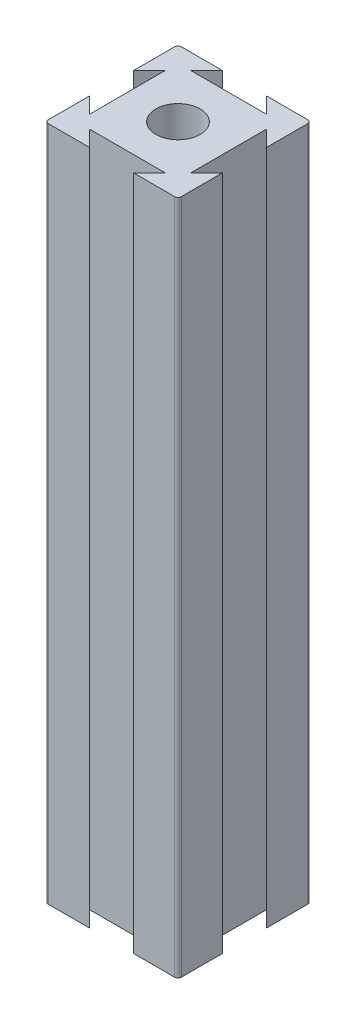
ISO-10303-21;
HEADER;
FILE_DESCRIPTION(('STEP AP214'),'2;1');
FILE_NAME('part.step','',(''),(''),'','','');
FILE_SCHEMA(('AUTOMOTIVE_DESIGN { 1 0 10303 214 1 1 1 1 }'));
ENDSEC;
DATA;
#1=APPLICATION_CONTEXT('core data for automotive mechanical design processes');
#2=APPLICATION_PROTOCOL_DEFINITION('international standard','automotive_design',2000,#1);
#3=PRODUCT_CONTEXT('',#1,'mechanical');
#4=PRODUCT('Part','Part','',(#3));
#5=PRODUCT_RELATED_PRODUCT_CATEGORY('part','',(#4));
#6=PRODUCT_DEFINITION_FORMATION('','',#4);
#7=PRODUCT_DEFINITION_CONTEXT('part definition',#1,'design');
#8=PRODUCT_DEFINITION('design','',#6,#7);
#9=PRODUCT_DEFINITION_SHAPE('','',#8);
#10=(LENGTH_UNIT() NAMED_UNIT(*) SI_UNIT(.MILLI.,.METRE.));
#11=(NAMED_UNIT(*) PLANE_ANGLE_UNIT() SI_UNIT($,.RADIAN.));
#12=(NAMED_UNIT(*) SI_UNIT($,.STERADIAN.) SOLID_ANGLE_UNIT());
#13=UNCERTAINTY_MEASURE_WITH_UNIT(LENGTH_MEASURE(1.E-05),#10,'distance_accuracy_value','');
#14=(GEOMETRIC_REPRESENTATION_CONTEXT(3) GLOBAL_UNCERTAINTY_ASSIGNED_CONTEXT((#13)) GLOBAL_UNIT_ASSIGNED_CONTEXT((#10,
#11,#12)) REPRESENTATION_CONTEXT('',''));
#15=CARTESIAN_POINT('',(0.,0.,0.));
#16=DIRECTION('',(0.,0.,1.));
#17=DIRECTION('',(1.,0.,0.));
#18=AXIS2_PLACEMENT_3D('',#15,#16,#17);
#19=CARTESIAN_POINT('',(16.6666666666667,101.6,-16.6666666666667));
#20=DIRECTION('',(-0.707106781186547,0.,0.707106781186548));
#21=DIRECTION('',(0.707106781186548,0.,0.707106781186547));
#22=AXIS2_PLACEMENT_3D('',#19,#20,#21);
#23=PLANE('',#22);
#24=DIRECTION('',(-0.707106781186548,0.,-0.707106781186547));
#25=VECTOR('',#24,1.);
#26=CARTESIAN_POINT('',(16.6666666666667,0.,-16.6666666666667));
#27=LINE('',#26,#25);
#28=CARTESIAN_POINT('',(20.,0.,-13.3333333333333));
#29=VERTEX_POINT('',#28);
#30=CARTESIAN_POINT('',(17.6183333333333,0.,-15.715));
#31=VERTEX_POINT('',#30);
#32=EDGE_CURVE('E201',#29,#31,#27,.T.);
#33=ORIENTED_EDGE('',*,*,#32,.F.);
#34=DIRECTION('',(0.,-1.,0.));
#35=VECTOR('',#34,1.);
#36=CARTESIAN_POINT('',(20.,101.6,-13.3333333333333));
#37=LINE('',#36,#35);
#38=CARTESIAN_POINT('',(20.,101.6,-13.3333333333333));
#39=VERTEX_POINT('',#38);
#40=EDGE_CURVE('E195',#39,#29,#37,.T.);
#41=ORIENTED_EDGE('',*,*,#40,.F.);
#42=DIRECTION('',(-0.707106781186548,0.,-0.707106781186547));
#43=VECTOR('',#42,1.);
#44=CARTESIAN_POINT('',(16.6666666666667,101.6,-16.6666666666667));
#45=LINE('',#44,#43);
#46=CARTESIAN_POINT('',(17.6183333333333,101.6,-15.715));
#47=VERTEX_POINT('',#46);
#48=EDGE_CURVE('E198',#39,#47,#45,.T.);
#49=ORIENTED_EDGE('',*,*,#48,.T.);
#50=DIRECTION('',(0.,-1.,0.));
#51=VECTOR('',#50,1.);
#52=CARTESIAN_POINT('',(17.6183333333333,101.6,-15.715));
#53=LINE('',#52,#51);
#54=EDGE_CURVE('E269',#47,#31,#53,.T.);
#55=ORIENTED_EDGE('',*,*,#54,.T.);
#56=EDGE_LOOP('',(#33,#41,#49,#55));
#57=FACE_BOUND('',#56,.T.);
#58=ADVANCED_FACE('F35',(#57),#23,.T.);
#59=CARTESIAN_POINT('',(20.,101.6,0.));
#60=DIRECTION('',(-1.,0.,0.));
#61=DIRECTION('',(0.,0.,1.));
#62=AXIS2_PLACEMENT_3D('',#59,#60,#61);
#63=PLANE('',#62);
#64=DIRECTION('',(0.,0.,-1.));
#65=VECTOR('',#64,1.);
#66=CARTESIAN_POINT('',(20.,0.,0.));
#67=LINE('',#66,#65);
#68=CARTESIAN_POINT('',(20.,0.,-19.492));
#69=VERTEX_POINT('',#68);
#70=EDGE_CURVE('E274',#29,#69,#67,.T.);
#71=ORIENTED_EDGE('',*,*,#70,.T.);
#72=DIRECTION('',(0.,-1.,0.));
#73=VECTOR('',#72,1.);
#74=CARTESIAN_POINT('',(20.,101.6,-19.492));
#75=LINE('',#74,#73);
#76=CARTESIAN_POINT('',(20.,101.6,-19.492));
#77=VERTEX_POINT('',#76);
#78=EDGE_CURVE('E212',#69,#77,#75,.F.);
#79=ORIENTED_EDGE('',*,*,#78,.T.);
#80=DIRECTION('',(0.,0.,-1.));
#81=VECTOR('',#80,1.);
#82=CARTESIAN_POINT('',(20.,101.6,0.));
#83=LINE('',#82,#81);
#84=EDGE_CURVE('E209',#39,#77,#83,.T.);
#85=ORIENTED_EDGE('',*,*,#84,.F.);
#86=ORIENTED_EDGE('',*,*,#40,.T.);
#87=EDGE_LOOP('',(#71,#79,#85,#86));
#88=FACE_BOUND('',#87,.T.);
#89=ADVANCED_FACE('F210',(#88),#63,.F.);
#90=CARTESIAN_POINT('',(0.,101.6,-20.));
#91=DIRECTION('',(0.,0.,-1.));
#92=DIRECTION('',(-1.,0.,0.));
#93=AXIS2_PLACEMENT_3D('',#90,#91,#92);
#94=PLANE('',#93);
#95=DIRECTION('',(1.,0.,0.));
#96=VECTOR('',#95,1.);
#97=CARTESIAN_POINT('',(0.,101.6,-20.));
#98=LINE('',#97,#96);
#99=CARTESIAN_POINT('',(13.3333333333333,101.6,-20.));
#100=VERTEX_POINT('',#99);
#101=CARTESIAN_POINT('',(19.492,101.6,-20.));
#102=VERTEX_POINT('',#101);
#103=EDGE_CURVE('E214',#100,#102,#98,.T.);
#104=ORIENTED_EDGE('',*,*,#103,.T.);
#105=DIRECTION('',(0.,-1.,0.));
#106=VECTOR('',#105,1.);
#107=CARTESIAN_POINT('',(19.492,0.,-20.));
#108=LINE('',#107,#106);
#109=CARTESIAN_POINT('',(19.492,0.,-20.));
#110=VERTEX_POINT('',#109);
#111=EDGE_CURVE('E376',#102,#110,#108,.T.);
#112=ORIENTED_EDGE('',*,*,#111,.T.);
#113=DIRECTION('',(1.,0.,0.));
#114=VECTOR('',#113,1.);
#115=CARTESIAN_POINT('',(0.,0.,-20.));
#116=LINE('',#115,#114);
#117=CARTESIAN_POINT('',(13.3333333333333,0.,-20.));
#118=VERTEX_POINT('',#117);
#119=EDGE_CURVE('E276',#118,#110,#116,.T.);
#120=ORIENTED_EDGE('',*,*,#119,.F.);
#121=DIRECTION('',(0.,-1.,0.));
#122=VECTOR('',#121,1.);
#123=CARTESIAN_POINT('',(13.3333333333333,101.6,-20.));
#124=LINE('',#123,#122);
#125=EDGE_CURVE('E206',#100,#118,#124,.T.);
#126=ORIENTED_EDGE('',*,*,#125,.F.);
#127=EDGE_LOOP('',(#104,#112,#120,#126));
#128=FACE_BOUND('',#127,.T.);
#129=ADVANCED_FACE('F408',(#128),#94,.T.);
#130=CARTESIAN_POINT('',(16.6666666666666,101.6,-16.6666666666668));
#131=DIRECTION('',(-0.707106781186544,0.,0.707106781186551));
#132=DIRECTION('',(0.707106781186551,0.,0.707106781186544));
#133=AXIS2_PLACEMENT_3D('',#130,#131,#132);
#134=PLANE('',#133);
#135=DIRECTION('',(-0.707106781186551,0.,-0.707106781186544));
#136=VECTOR('',#135,1.);
#137=CARTESIAN_POINT('',(16.6666666666666,0.,-16.6666666666668));
#138=LINE('',#137,#136);
#139=CARTESIAN_POINT('',(15.715,0.,-17.6183333333334));
#140=VERTEX_POINT('',#139);
#141=EDGE_CURVE('E280',#140,#118,#138,.T.);
#142=ORIENTED_EDGE('',*,*,#141,.F.);
#143=DIRECTION('',(0.,-1.,0.));
#144=VECTOR('',#143,1.);
#145=CARTESIAN_POINT('',(15.715,101.6,-17.6183333333334));
#146=LINE('',#145,#144);
#147=CARTESIAN_POINT('',(15.715,101.6,-17.6183333333334));
#148=VERTEX_POINT('',#147);
#149=EDGE_CURVE('E354',#148,#140,#146,.T.);
#150=ORIENTED_EDGE('',*,*,#149,.F.);
#151=DIRECTION('',(-0.707106781186551,0.,-0.707106781186544));
#152=VECTOR('',#151,1.);
#153=CARTESIAN_POINT('',(16.6666666666666,101.6,-16.6666666666668));
#154=LINE('',#153,#152);
#155=EDGE_CURVE('E230',#148,#100,#154,.T.);
#156=ORIENTED_EDGE('',*,*,#155,.T.);
#157=ORIENTED_EDGE('',*,*,#125,.T.);
#158=EDGE_LOOP('',(#142,#150,#156,#157));
#159=FACE_BOUND('',#158,.T.);
#160=ADVANCED_FACE('F412',(#159),#134,.T.);
#161=CARTESIAN_POINT('',(0.,101.6,-17.6183333333334));
#162=DIRECTION('',(0.,0.,-1.));
#163=DIRECTION('',(-1.,0.,0.));
#164=AXIS2_PLACEMENT_3D('',#161,#162,#163);
#165=PLANE('',#164);
#166=DIRECTION('',(1.,0.,0.));
#167=VECTOR('',#166,1.);
#168=CARTESIAN_POINT('',(0.,0.,-17.6183333333334));
#169=LINE('',#168,#167);
#170=CARTESIAN_POINT('',(4.285,0.,-17.6183333333334));
#171=VERTEX_POINT('',#170);
#172=EDGE_CURVE('E284',#171,#140,#169,.T.);
#173=ORIENTED_EDGE('',*,*,#172,.F.);
#174=DIRECTION('',(0.,-1.,0.));
#175=VECTOR('',#174,1.);
#176=CARTESIAN_POINT('',(4.285,101.6,-17.6183333333334));
#177=LINE('',#176,#175);
#178=CARTESIAN_POINT('',(4.285,101.6,-17.6183333333334));
#179=VERTEX_POINT('',#178);
#180=EDGE_CURVE('E352',#179,#171,#177,.T.);
#181=ORIENTED_EDGE('',*,*,#180,.F.);
#182=DIRECTION('',(1.,0.,0.));
#183=VECTOR('',#182,1.);
#184=CARTESIAN_POINT('',(0.,101.6,-17.6183333333334));
#185=LINE('',#184,#183);
#186=EDGE_CURVE('E234',#179,#148,#185,.T.);
#187=ORIENTED_EDGE('',*,*,#186,.T.);
#188=ORIENTED_EDGE('',*,*,#149,.T.);
#189=EDGE_LOOP('',(#173,#181,#187,#188));
#190=FACE_BOUND('',#189,.T.);
#191=ADVANCED_FACE('F439',(#190),#165,.T.);
#192=CARTESIAN_POINT('',(-6.6666666666667,101.6,-6.66666666666677));
#193=DIRECTION('',(0.707106781186544,0.,0.707106781186551));
#194=DIRECTION('',(0.707106781186551,0.,-0.707106781186544));
#195=AXIS2_PLACEMENT_3D('',#192,#193,#194);
#196=PLANE('',#195);
#197=DIRECTION('',(-0.707106781186551,0.,0.707106781186544));
#198=VECTOR('',#197,1.);
#199=CARTESIAN_POINT('',(-6.6666666666667,0.,-6.66666666666677));
#200=LINE('',#199,#198);
#201=CARTESIAN_POINT('',(6.66666666666666,0.,-20.));
#202=VERTEX_POINT('',#201);
#203=EDGE_CURVE('E287',#202,#171,#200,.T.);
#204=ORIENTED_EDGE('',*,*,#203,.F.);
#205=DIRECTION('',(0.,-1.,0.));
#206=VECTOR('',#205,1.);
#207=CARTESIAN_POINT('',(6.66666666666666,101.6,-20.));
#208=LINE('',#207,#206);
#209=CARTESIAN_POINT('',(6.66666666666666,101.6,-20.));
#210=VERTEX_POINT('',#209);
#211=EDGE_CURVE('E349',#210,#202,#208,.T.);
#212=ORIENTED_EDGE('',*,*,#211,.F.);
#213=DIRECTION('',(-0.707106781186551,0.,0.707106781186544));
#214=VECTOR('',#213,1.);
#215=CARTESIAN_POINT('',(-6.6666666666667,101.6,-6.66666666666677));
#216=LINE('',#215,#214);
#217=EDGE_CURVE('E237',#210,#179,#216,.T.);
#218=ORIENTED_EDGE('',*,*,#217,.T.);
#219=ORIENTED_EDGE('',*,*,#180,.T.);
#220=EDGE_LOOP('',(#204,#212,#218,#219));
#221=FACE_BOUND('',#220,.T.);
#222=ADVANCED_FACE('F442',(#221),#196,.T.);
#223=CARTESIAN_POINT('',(0.508,0.,-20.));
#224=VERTEX_POINT('',#223);
#225=EDGE_CURVE('E281',#224,#202,#116,.T.);
#226=ORIENTED_EDGE('',*,*,#225,.F.);
#227=DIRECTION('',(0.,-1.,0.));
#228=VECTOR('',#227,1.);
#229=CARTESIAN_POINT('',(0.508,101.6,-20.));
#230=LINE('',#229,#228);
#231=CARTESIAN_POINT('',(0.508,101.6,-20.));
#232=VERTEX_POINT('',#231);
#233=EDGE_CURVE('E367',#224,#232,#230,.F.);
#234=ORIENTED_EDGE('',*,*,#233,.T.);
#235=EDGE_CURVE('E231',#232,#210,#98,.T.);
#236=ORIENTED_EDGE('',*,*,#235,.T.);
#237=ORIENTED_EDGE('',*,*,#211,.T.);
#238=EDGE_LOOP('',(#226,#234,#236,#237));
#239=FACE_BOUND('',#238,.T.);
#240=ADVANCED_FACE('F505',(#239),#94,.T.);
#241=CARTESIAN_POINT('',(0.,101.6,0.));
#242=DIRECTION('',(-1.,0.,0.));
#243=DIRECTION('',(0.,0.,1.));
#244=AXIS2_PLACEMENT_3D('',#241,#242,#243);
#245=PLANE('',#244);
#246=DIRECTION('',(0.,0.,-1.));
#247=VECTOR('',#246,1.);
#248=CARTESIAN_POINT('',(0.,101.6,0.));
#249=LINE('',#248,#247);
#250=CARTESIAN_POINT('',(0.,101.6,-13.3333333333333));
#251=VERTEX_POINT('',#250);
#252=CARTESIAN_POINT('',(0.,101.6,-19.492));
#253=VERTEX_POINT('',#252);
#254=EDGE_CURVE('E240',#251,#253,#249,.T.);
#255=ORIENTED_EDGE('',*,*,#254,.T.);
#256=DIRECTION('',(0.,-1.,0.));
#257=VECTOR('',#256,1.);
#258=CARTESIAN_POINT('',(0.,101.6,-19.492));
#259=LINE('',#258,#257);
#260=CARTESIAN_POINT('',(0.,0.,-19.492));
#261=VERTEX_POINT('',#260);
#262=EDGE_CURVE('E205',#253,#261,#259,.T.);
#263=ORIENTED_EDGE('',*,*,#262,.T.);
#264=DIRECTION('',(0.,0.,-1.));
#265=VECTOR('',#264,1.);
#266=CARTESIAN_POINT('',(0.,0.,0.));
#267=LINE('',#266,#265);
#268=CARTESIAN_POINT('',(0.,0.,-13.3333333333333));
#269=VERTEX_POINT('',#268);
#270=EDGE_CURVE('E290',#269,#261,#267,.T.);
#271=ORIENTED_EDGE('',*,*,#270,.F.);
#272=DIRECTION('',(0.,-1.,0.));
#273=VECTOR('',#272,1.);
#274=CARTESIAN_POINT('',(0.,101.6,-13.3333333333333));
#275=LINE('',#274,#273);
#276=EDGE_CURVE('E347',#251,#269,#275,.T.);
#277=ORIENTED_EDGE('',*,*,#276,.F.);
#278=EDGE_LOOP('',(#255,#263,#271,#277));
#279=FACE_BOUND('',#278,.T.);
#280=ADVANCED_FACE('F451',(#279),#245,.T.);
#281=CARTESIAN_POINT('',(-6.66666666666667,101.6,-6.66666666666669));
#282=DIRECTION('',(-0.707106781186547,0.,-0.707106781186548));
#283=DIRECTION('',(-0.707106781186548,0.,0.707106781186547));
#284=AXIS2_PLACEMENT_3D('',#281,#282,#283);
#285=PLANE('',#284);
#286=DIRECTION('',(0.707106781186549,0.,-0.707106781186547));
#287=VECTOR('',#286,1.);
#288=CARTESIAN_POINT('',(-6.66666666666667,0.,-6.66666666666669));
#289=LINE('',#288,#287);
#290=CARTESIAN_POINT('',(2.38166666666667,0.,-15.715));
#291=VERTEX_POINT('',#290);
#292=EDGE_CURVE('E293',#269,#291,#289,.T.);
#293=ORIENTED_EDGE('',*,*,#292,.T.);
#294=DIRECTION('',(0.,-1.,0.));
#295=VECTOR('',#294,1.);
#296=CARTESIAN_POINT('',(2.38166666666667,101.6,-15.715));
#297=LINE('',#296,#295);
#298=CARTESIAN_POINT('',(2.38166666666667,101.6,-15.715));
#299=VERTEX_POINT('',#298);
#300=EDGE_CURVE('E344',#299,#291,#297,.T.);
#301=ORIENTED_EDGE('',*,*,#300,.F.);
#302=DIRECTION('',(0.707106781186549,0.,-0.707106781186547));
#303=VECTOR('',#302,1.);
#304=CARTESIAN_POINT('',(-6.66666666666667,101.6,-6.66666666666669));
#305=LINE('',#304,#303);
#306=EDGE_CURVE('E243',#251,#299,#305,.T.);
#307=ORIENTED_EDGE('',*,*,#306,.F.);
#308=ORIENTED_EDGE('',*,*,#276,.T.);
#309=EDGE_LOOP('',(#293,#301,#307,#308));
#310=FACE_BOUND('',#309,.T.);
#311=ADVANCED_FACE('F456',(#310),#285,.F.);
#312=CARTESIAN_POINT('',(2.38166666666667,101.6,0.));
#313=DIRECTION('',(1.,0.,0.));
#314=DIRECTION('',(0.,0.,-1.));
#315=AXIS2_PLACEMENT_3D('',#312,#313,#314);
#316=PLANE('',#315);
#317=DIRECTION('',(0.,0.,1.));
#318=VECTOR('',#317,1.);
#319=CARTESIAN_POINT('',(2.38166666666667,0.,0.));
#320=LINE('',#319,#318);
#321=CARTESIAN_POINT('',(2.38166666666667,0.,-4.285));
#322=VERTEX_POINT('',#321);
#323=EDGE_CURVE('E297',#291,#322,#320,.T.);
#324=ORIENTED_EDGE('',*,*,#323,.T.);
#325=DIRECTION('',(0.,-1.,0.));
#326=VECTOR('',#325,1.);
#327=CARTESIAN_POINT('',(2.38166666666667,101.6,-4.285));
#328=LINE('',#327,#326);
#329=CARTESIAN_POINT('',(2.38166666666667,101.6,-4.285));
#330=VERTEX_POINT('',#329);
#331=EDGE_CURVE('E341',#330,#322,#328,.T.);
#332=ORIENTED_EDGE('',*,*,#331,.F.);
#333=DIRECTION('',(0.,0.,1.));
#334=VECTOR('',#333,1.);
#335=CARTESIAN_POINT('',(2.38166666666667,101.6,0.));
#336=LINE('',#335,#334);
#337=EDGE_CURVE('E247',#299,#330,#336,.T.);
#338=ORIENTED_EDGE('',*,*,#337,.F.);
#339=ORIENTED_EDGE('',*,*,#300,.T.);
#340=EDGE_LOOP('',(#324,#332,#338,#339));
#341=FACE_BOUND('',#340,.T.);
#342=ADVANCED_FACE('F462',(#341),#316,.F.);
#343=CARTESIAN_POINT('',(3.33333333333333,101.6,-3.33333333333335));
#344=DIRECTION('',(-0.707106781186546,0.,0.707106781186549));
#345=DIRECTION('',(0.707106781186549,0.,0.707106781186546));
#346=AXIS2_PLACEMENT_3D('',#343,#344,#345);
#347=PLANE('',#346);
#348=DIRECTION('',(-0.707106781186549,0.,-0.707106781186546));
#349=VECTOR('',#348,1.);
#350=CARTESIAN_POINT('',(3.33333333333333,0.,-3.33333333333335));
#351=LINE('',#350,#349);
#352=CARTESIAN_POINT('',(0.,0.,-6.66666666666667));
#353=VERTEX_POINT('',#352);
#354=EDGE_CURVE('E300',#322,#353,#351,.T.);
#355=ORIENTED_EDGE('',*,*,#354,.T.);
#356=DIRECTION('',(0.,-1.,0.));
#357=VECTOR('',#356,1.);
#358=CARTESIAN_POINT('',(0.,101.6,-6.66666666666667));
#359=LINE('',#358,#357);
#360=CARTESIAN_POINT('',(0.,101.6,-6.66666666666667));
#361=VERTEX_POINT('',#360);
#362=EDGE_CURVE('E338',#361,#353,#359,.T.);
#363=ORIENTED_EDGE('',*,*,#362,.F.);
#364=DIRECTION('',(-0.707106781186549,0.,-0.707106781186546));
#365=VECTOR('',#364,1.);
#366=CARTESIAN_POINT('',(3.33333333333333,101.6,-3.33333333333335));
#367=LINE('',#366,#365);
#368=EDGE_CURVE('E250',#330,#361,#367,.T.);
#369=ORIENTED_EDGE('',*,*,#368,.F.);
#370=ORIENTED_EDGE('',*,*,#331,.T.);
#371=EDGE_LOOP('',(#355,#363,#369,#370));
#372=FACE_BOUND('',#371,.T.);
#373=ADVANCED_FACE('F464',(#372),#347,.F.);
#374=CARTESIAN_POINT('',(0.,0.,-0.508));
#375=VERTEX_POINT('',#374);
#376=EDGE_CURVE('E294',#375,#353,#267,.T.);
#377=ORIENTED_EDGE('',*,*,#376,.F.);
#378=DIRECTION('',(0.,-1.,0.));
#379=VECTOR('',#378,1.);
#380=CARTESIAN_POINT('',(0.,101.6,-0.508));
#381=LINE('',#380,#379);
#382=CARTESIAN_POINT('',(0.,101.6,-0.508));
#383=VERTEX_POINT('',#382);
#384=EDGE_CURVE('E383',#375,#383,#381,.F.);
#385=ORIENTED_EDGE('',*,*,#384,.T.);
#386=EDGE_CURVE('E244',#383,#361,#249,.T.);
#387=ORIENTED_EDGE('',*,*,#386,.T.);
#388=ORIENTED_EDGE('',*,*,#362,.T.);
#389=EDGE_LOOP('',(#377,#385,#387,#388));
#390=FACE_BOUND('',#389,.T.);
#391=ADVANCED_FACE('F467',(#390),#245,.T.);
#392=CARTESIAN_POINT('',(0.,101.6,0.));
#393=DIRECTION('',(0.,0.,-1.));
#394=DIRECTION('',(-1.,0.,0.));
#395=AXIS2_PLACEMENT_3D('',#392,#393,#394);
#396=PLANE('',#395);
#397=DIRECTION('',(1.,0.,0.));
#398=VECTOR('',#397,1.);
#399=CARTESIAN_POINT('',(0.,101.6,0.));
#400=LINE('',#399,#398);
#401=CARTESIAN_POINT('',(0.508,101.6,0.));
#402=VERTEX_POINT('',#401);
#403=CARTESIAN_POINT('',(6.66666666666667,101.6,0.));
#404=VERTEX_POINT('',#403);
#405=EDGE_CURVE('E253',#402,#404,#400,.T.);
#406=ORIENTED_EDGE('',*,*,#405,.F.);
#407=DIRECTION('',(0.,-1.,0.));
#408=VECTOR('',#407,1.);
#409=CARTESIAN_POINT('',(0.508,0.,0.));
#410=LINE('',#409,#408);
#411=CARTESIAN_POINT('',(0.508,0.,0.));
#412=VERTEX_POINT('',#411);
#413=EDGE_CURVE('E380',#402,#412,#410,.T.);
#414=ORIENTED_EDGE('',*,*,#413,.T.);
#415=DIRECTION('',(1.,0.,0.));
#416=VECTOR('',#415,1.);
#417=CARTESIAN_POINT('',(0.,0.,0.));
#418=LINE('',#417,#416);
#419=CARTESIAN_POINT('',(6.66666666666667,0.,0.));
#420=VERTEX_POINT('',#419);
#421=EDGE_CURVE('E303',#412,#420,#418,.T.);
#422=ORIENTED_EDGE('',*,*,#421,.T.);
#423=DIRECTION('',(0.,-1.,0.));
#424=VECTOR('',#423,1.);
#425=CARTESIAN_POINT('',(6.66666666666667,101.6,0.));
#426=LINE('',#425,#424);
#427=EDGE_CURVE('E335',#404,#420,#426,.T.);
#428=ORIENTED_EDGE('',*,*,#427,.F.);
#429=EDGE_LOOP('',(#406,#414,#422,#428));
#430=FACE_BOUND('',#429,.T.);
#431=ADVANCED_FACE('F474',(#430),#396,.F.);
#432=CARTESIAN_POINT('',(3.3333333333333,101.6,-3.33333333333333));
#433=DIRECTION('',(-0.707106781186544,0.,0.707106781186551));
#434=DIRECTION('',(0.707106781186551,0.,0.707106781186544));
#435=AXIS2_PLACEMENT_3D('',#432,#433,#434);
#436=PLANE('',#435);
#437=DIRECTION('',(-0.707106781186551,0.,-0.707106781186544));
#438=VECTOR('',#437,1.);
#439=CARTESIAN_POINT('',(3.3333333333333,0.,-3.33333333333333));
#440=LINE('',#439,#438);
#441=CARTESIAN_POINT('',(4.285,0.,-2.38166666666664));
#442=VERTEX_POINT('',#441);
#443=EDGE_CURVE('E305',#420,#442,#440,.T.);
#444=ORIENTED_EDGE('',*,*,#443,.T.);
#445=DIRECTION('',(0.,-1.,0.));
#446=VECTOR('',#445,1.);
#447=CARTESIAN_POINT('',(4.285,101.6,-2.38166666666664));
#448=LINE('',#447,#446);
#449=CARTESIAN_POINT('',(4.285,101.6,-2.38166666666664));
#450=VERTEX_POINT('',#449);
#451=EDGE_CURVE('E332',#450,#442,#448,.T.);
#452=ORIENTED_EDGE('',*,*,#451,.F.);
#453=DIRECTION('',(-0.707106781186551,0.,-0.707106781186544));
#454=VECTOR('',#453,1.);
#455=CARTESIAN_POINT('',(3.3333333333333,101.6,-3.33333333333333));
#456=LINE('',#455,#454);
#457=EDGE_CURVE('E255',#404,#450,#456,.T.);
#458=ORIENTED_EDGE('',*,*,#457,.F.);
#459=ORIENTED_EDGE('',*,*,#427,.T.);
#460=EDGE_LOOP('',(#444,#452,#458,#459));
#461=FACE_BOUND('',#460,.T.);
#462=ADVANCED_FACE('F480',(#461),#436,.F.);
#463=CARTESIAN_POINT('',(0.,101.6,-2.38166666666664));
#464=DIRECTION('',(0.,0.,-1.));
#465=DIRECTION('',(-1.,0.,0.));
#466=AXIS2_PLACEMENT_3D('',#463,#464,#465);
#467=PLANE('',#466);
#468=DIRECTION('',(1.,0.,0.));
#469=VECTOR('',#468,1.);
#470=CARTESIAN_POINT('',(0.,0.,-2.38166666666664));
#471=LINE('',#470,#469);
#472=CARTESIAN_POINT('',(15.715,0.,-2.38166666666664));
#473=VERTEX_POINT('',#472);
#474=EDGE_CURVE('E309',#442,#473,#471,.T.);
#475=ORIENTED_EDGE('',*,*,#474,.T.);
#476=DIRECTION('',(0.,-1.,0.));
#477=VECTOR('',#476,1.);
#478=CARTESIAN_POINT('',(15.715,101.6,-2.38166666666664));
#479=LINE('',#478,#477);
#480=CARTESIAN_POINT('',(15.715,101.6,-2.38166666666664));
#481=VERTEX_POINT('',#480);
#482=EDGE_CURVE('E329',#481,#473,#479,.T.);
#483=ORIENTED_EDGE('',*,*,#482,.F.);
#484=DIRECTION('',(1.,0.,0.));
#485=VECTOR('',#484,1.);
#486=CARTESIAN_POINT('',(0.,101.6,-2.38166666666664));
#487=LINE('',#486,#485);
#488=EDGE_CURVE('E259',#450,#481,#487,.T.);
#489=ORIENTED_EDGE('',*,*,#488,.F.);
#490=ORIENTED_EDGE('',*,*,#451,.T.);
#491=EDGE_LOOP('',(#475,#483,#489,#490));
#492=FACE_BOUND('',#491,.T.);
#493=ADVANCED_FACE('F483',(#492),#467,.F.);
#494=CARTESIAN_POINT('',(6.66666666666659,101.6,6.66666666666667));
#495=DIRECTION('',(0.707106781186544,0.,0.707106781186551));
#496=DIRECTION('',(0.707106781186551,0.,-0.707106781186544));
#497=AXIS2_PLACEMENT_3D('',#494,#495,#496);
#498=PLANE('',#497);
#499=DIRECTION('',(-0.707106781186551,0.,0.707106781186544));
#500=VECTOR('',#499,1.);
#501=CARTESIAN_POINT('',(6.66666666666659,0.,6.66666666666667));
#502=LINE('',#501,#500);
#503=CARTESIAN_POINT('',(13.3333333333333,0.,0.));
#504=VERTEX_POINT('',#503);
#505=EDGE_CURVE('E312',#473,#504,#502,.T.);
#506=ORIENTED_EDGE('',*,*,#505,.T.);
#507=DIRECTION('',(0.,-1.,0.));
#508=VECTOR('',#507,1.);
#509=CARTESIAN_POINT('',(13.3333333333333,101.6,0.));
#510=LINE('',#509,#508);
#511=CARTESIAN_POINT('',(13.3333333333333,101.6,0.));
#512=VERTEX_POINT('',#511);
#513=EDGE_CURVE('E326',#512,#504,#510,.T.);
#514=ORIENTED_EDGE('',*,*,#513,.F.);
#515=DIRECTION('',(-0.707106781186551,0.,0.707106781186544));
#516=VECTOR('',#515,1.);
#517=CARTESIAN_POINT('',(6.66666666666659,101.6,6.66666666666667));
#518=LINE('',#517,#516);
#519=EDGE_CURVE('E262',#481,#512,#518,.T.);
#520=ORIENTED_EDGE('',*,*,#519,.F.);
#521=ORIENTED_EDGE('',*,*,#482,.T.);
#522=EDGE_LOOP('',(#506,#514,#520,#521));
#523=FACE_BOUND('',#522,.T.);
#524=ADVANCED_FACE('F485',(#523),#498,.F.);
#525=CARTESIAN_POINT('',(19.492,0.,0.));
#526=VERTEX_POINT('',#525);
#527=EDGE_CURVE('E306',#504,#526,#418,.T.);
#528=ORIENTED_EDGE('',*,*,#527,.T.);
#529=DIRECTION('',(0.,-1.,0.));
#530=VECTOR('',#529,1.);
#531=CARTESIAN_POINT('',(19.492,101.6,0.));
#532=LINE('',#531,#530);
#533=CARTESIAN_POINT('',(19.492,101.6,0.));
#534=VERTEX_POINT('',#533);
#535=EDGE_CURVE('E11',#526,#534,#532,.F.);
#536=ORIENTED_EDGE('',*,*,#535,.T.);
#537=EDGE_CURVE('E256',#512,#534,#400,.T.);
#538=ORIENTED_EDGE('',*,*,#537,.F.);
#539=ORIENTED_EDGE('',*,*,#513,.T.);
#540=EDGE_LOOP('',(#528,#536,#538,#539));
#541=FACE_BOUND('',#540,.T.);
#542=ADVANCED_FACE('F394',(#541),#396,.F.);
#543=CARTESIAN_POINT('',(20.,101.6,-0.508));
#544=VERTEX_POINT('',#543);
#545=CARTESIAN_POINT('',(20.,101.6,-6.66666666666667));
#546=VERTEX_POINT('',#545);
#547=EDGE_CURVE('E216',#544,#546,#83,.T.);
#548=ORIENTED_EDGE('',*,*,#547,.F.);
#549=DIRECTION('',(0.,-1.,0.));
#550=VECTOR('',#549,1.);
#551=CARTESIAN_POINT('',(20.,101.6,-0.508));
#552=LINE('',#551,#550);
#553=CARTESIAN_POINT('',(20.,0.,-0.508));
#554=VERTEX_POINT('',#553);
#555=EDGE_CURVE('E43',#544,#554,#552,.T.);
#556=ORIENTED_EDGE('',*,*,#555,.T.);
#557=CARTESIAN_POINT('',(20.,0.,-6.66666666666667));
#558=VERTEX_POINT('',#557);
#559=EDGE_CURVE('E277',#554,#558,#67,.T.);
#560=ORIENTED_EDGE('',*,*,#559,.T.);
#561=DIRECTION('',(0.,-1.,0.));
#562=VECTOR('',#561,1.);
#563=CARTESIAN_POINT('',(20.,101.6,-6.66666666666667));
#564=LINE('',#563,#562);
#565=EDGE_CURVE('E323',#546,#558,#564,.T.);
#566=ORIENTED_EDGE('',*,*,#565,.F.);
#567=EDGE_LOOP('',(#548,#556,#560,#566));
#568=FACE_BOUND('',#567,.T.);
#569=ADVANCED_FACE('F388',(#568),#63,.F.);
#570=CARTESIAN_POINT('',(6.66666666666663,101.6,6.66666666666666));
#571=DIRECTION('',(-0.707106781186546,0.,-0.707106781186549));
#572=DIRECTION('',(-0.707106781186549,0.,0.707106781186546));
#573=AXIS2_PLACEMENT_3D('',#570,#571,#572);
#574=PLANE('',#573);
#575=DIRECTION('',(0.707106781186549,0.,-0.707106781186546));
#576=VECTOR('',#575,1.);
#577=CARTESIAN_POINT('',(6.66666666666663,0.,6.66666666666666));
#578=LINE('',#577,#576);
#579=CARTESIAN_POINT('',(17.6183333333333,0.,-4.285));
#580=VERTEX_POINT('',#579);
#581=EDGE_CURVE('E315',#580,#558,#578,.T.);
#582=ORIENTED_EDGE('',*,*,#581,.F.);
#583=DIRECTION('',(0.,-1.,0.));
#584=VECTOR('',#583,1.);
#585=CARTESIAN_POINT('',(17.6183333333333,101.6,-4.285));
#586=LINE('',#585,#584);
#587=CARTESIAN_POINT('',(17.6183333333333,101.6,-4.285));
#588=VERTEX_POINT('',#587);
#589=EDGE_CURVE('E321',#588,#580,#586,.T.);
#590=ORIENTED_EDGE('',*,*,#589,.F.);
#591=DIRECTION('',(0.707106781186549,0.,-0.707106781186546));
#592=VECTOR('',#591,1.);
#593=CARTESIAN_POINT('',(6.66666666666663,101.6,6.66666666666666));
#594=LINE('',#593,#592);
#595=EDGE_CURVE('E265',#588,#546,#594,.T.);
#596=ORIENTED_EDGE('',*,*,#595,.T.);
#597=ORIENTED_EDGE('',*,*,#565,.T.);
#598=EDGE_LOOP('',(#582,#590,#596,#597));
#599=FACE_BOUND('',#598,.T.);
#600=ADVANCED_FACE('F418',(#599),#574,.T.);
#601=CARTESIAN_POINT('',(10.,101.6,-10.));
#602=DIRECTION('',(0.,-1.,0.));
#603=DIRECTION('',(0.,0.,-1.));
#604=AXIS2_PLACEMENT_3D('',#601,#602,#603);
#605=CYLINDRICAL_SURFACE('',#604,3.33333333333333);
#606=CARTESIAN_POINT('',(10.,101.6,-10.));
#607=DIRECTION('',(0.,1.,0.));
#608=DIRECTION('',(0.,0.,1.));
#609=AXIS2_PLACEMENT_3D('',#606,#607,#608);
#610=CIRCLE('',#609,3.33333333333333);
#611=CARTESIAN_POINT('',(10.,101.6,-6.66666666666667));
#612=VERTEX_POINT('',#611);
#613=EDGE_CURVE('E222',#612,#612,#610,.T.);
#614=ORIENTED_EDGE('',*,*,#613,.T.);
#615=EDGE_LOOP('',(#614));
#616=FACE_BOUND('',#615,.T.);
#617=CARTESIAN_POINT('',(10.,0.,-10.));
#618=DIRECTION('',(0.,1.,0.));
#619=DIRECTION('',(0.,0.,1.));
#620=AXIS2_PLACEMENT_3D('',#617,#618,#619);
#621=CIRCLE('',#620,3.33333333333333);
#622=CARTESIAN_POINT('',(10.,0.,-6.66666666666667));
#623=VERTEX_POINT('',#622);
#624=EDGE_CURVE('E270',#623,#623,#621,.T.);
#625=ORIENTED_EDGE('',*,*,#624,.F.);
#626=EDGE_LOOP('',(#625));
#627=FACE_BOUND('',#626,.T.);
#628=ADVANCED_FACE('F414',(#616,#627),#605,.F.);
#629=CARTESIAN_POINT('',(17.6183333333333,101.6,0.));
#630=DIRECTION('',(1.,0.,0.));
#631=DIRECTION('',(0.,0.,-1.));
#632=AXIS2_PLACEMENT_3D('',#629,#630,#631);
#633=PLANE('',#632);
#634=DIRECTION('',(0.,0.,1.));
#635=VECTOR('',#634,1.);
#636=CARTESIAN_POINT('',(17.6183333333333,0.,0.));
#637=LINE('',#636,#635);
#638=EDGE_CURVE('E225',#31,#580,#637,.T.);
#639=ORIENTED_EDGE('',*,*,#638,.F.);
#640=ORIENTED_EDGE('',*,*,#54,.F.);
#641=DIRECTION('',(0.,0.,1.));
#642=VECTOR('',#641,1.);
#643=CARTESIAN_POINT('',(17.6183333333333,101.6,0.));
#644=LINE('',#643,#642);
#645=EDGE_CURVE('E221',#47,#588,#644,.T.);
#646=ORIENTED_EDGE('',*,*,#645,.T.);
#647=ORIENTED_EDGE('',*,*,#589,.T.);
#648=EDGE_LOOP('',(#639,#640,#646,#647));
#649=FACE_BOUND('',#648,.T.);
#650=ADVANCED_FACE('F417',(#649),#633,.T.);
#651=CARTESIAN_POINT('',(0.,101.6,0.));
#652=DIRECTION('',(0.,1.,0.));
#653=DIRECTION('',(0.,0.,1.));
#654=AXIS2_PLACEMENT_3D('',#651,#652,#653);
#655=PLANE('',#654);
#656=ORIENTED_EDGE('',*,*,#613,.F.);
#657=EDGE_LOOP('',(#656));
#658=FACE_BOUND('',#657,.T.);
#659=ORIENTED_EDGE('',*,*,#235,.F.);
#660=CARTESIAN_POINT('',(0.508,101.6,-19.492));
#661=DIRECTION('',(0.,1.,0.));
#662=DIRECTION('',(0.,0.,1.));
#663=AXIS2_PLACEMENT_3D('',#660,#661,#662);
#664=CIRCLE('',#663,0.508);
#665=EDGE_CURVE('E374',#232,#253,#664,.T.);
#666=ORIENTED_EDGE('',*,*,#665,.T.);
#667=ORIENTED_EDGE('',*,*,#254,.F.);
#668=ORIENTED_EDGE('',*,*,#306,.T.);
#669=ORIENTED_EDGE('',*,*,#337,.T.);
#670=ORIENTED_EDGE('',*,*,#368,.T.);
#671=ORIENTED_EDGE('',*,*,#386,.F.);
#672=CARTESIAN_POINT('',(0.508,101.6,-0.508));
#673=DIRECTION('',(0.,1.,0.));
#674=DIRECTION('',(0.,0.,1.));
#675=AXIS2_PLACEMENT_3D('',#672,#673,#674);
#676=CIRCLE('',#675,0.508);
#677=EDGE_CURVE('E370',#383,#402,#676,.T.);
#678=ORIENTED_EDGE('',*,*,#677,.T.);
#679=ORIENTED_EDGE('',*,*,#405,.T.);
#680=ORIENTED_EDGE('',*,*,#457,.T.);
#681=ORIENTED_EDGE('',*,*,#488,.T.);
#682=ORIENTED_EDGE('',*,*,#519,.T.);
#683=ORIENTED_EDGE('',*,*,#537,.T.);
#684=CARTESIAN_POINT('',(19.492,101.6,-0.508));
#685=DIRECTION('',(0.,1.,0.));
#686=DIRECTION('',(0.,0.,1.));
#687=AXIS2_PLACEMENT_3D('',#684,#685,#686);
#688=CIRCLE('',#687,0.508);
#689=EDGE_CURVE('E50',#534,#544,#688,.T.);
#690=ORIENTED_EDGE('',*,*,#689,.T.);
#691=ORIENTED_EDGE('',*,*,#547,.T.);
#692=ORIENTED_EDGE('',*,*,#595,.F.);
#693=ORIENTED_EDGE('',*,*,#645,.F.);
#694=ORIENTED_EDGE('',*,*,#48,.F.);
#695=ORIENTED_EDGE('',*,*,#84,.T.);
#696=CARTESIAN_POINT('',(19.492,101.6,-19.492));
#697=DIRECTION('',(0.,1.,0.));
#698=DIRECTION('',(0.,0.,1.));
#699=AXIS2_PLACEMENT_3D('',#696,#697,#698);
#700=CIRCLE('',#699,0.508);
#701=EDGE_CURVE('E372',#77,#102,#700,.T.);
#702=ORIENTED_EDGE('',*,*,#701,.T.);
#703=ORIENTED_EDGE('',*,*,#103,.F.);
#704=ORIENTED_EDGE('',*,*,#155,.F.);
#705=ORIENTED_EDGE('',*,*,#186,.F.);
#706=ORIENTED_EDGE('',*,*,#217,.F.);
#707=EDGE_LOOP('',(#659,#666,#667,#668,#669,#670,#671,#678,#679,#680,#681,#682,#683,#690,#691,
#692,#693,#694,#695,#702,#703,#704,#705,#706));
#708=FACE_BOUND('',#707,.T.);
#709=ADVANCED_FACE('F218',(#658,#708),#655,.T.);
#710=CARTESIAN_POINT('',(0.,0.,0.));
#711=DIRECTION('',(0.,1.,0.));
#712=DIRECTION('',(0.,0.,1.));
#713=AXIS2_PLACEMENT_3D('',#710,#711,#712);
#714=PLANE('',#713);
#715=ORIENTED_EDGE('',*,*,#624,.T.);
#716=EDGE_LOOP('',(#715));
#717=FACE_BOUND('',#716,.T.);
#718=ORIENTED_EDGE('',*,*,#270,.T.);
#719=CARTESIAN_POINT('',(0.508,0.,-19.492));
#720=DIRECTION('',(0.,1.,0.));
#721=DIRECTION('',(0.,0.,1.));
#722=AXIS2_PLACEMENT_3D('',#719,#720,#721);
#723=CIRCLE('',#722,0.508);
#724=EDGE_CURVE('E365',#261,#224,#723,.F.);
#725=ORIENTED_EDGE('',*,*,#724,.T.);
#726=ORIENTED_EDGE('',*,*,#225,.T.);
#727=ORIENTED_EDGE('',*,*,#203,.T.);
#728=ORIENTED_EDGE('',*,*,#172,.T.);
#729=ORIENTED_EDGE('',*,*,#141,.T.);
#730=ORIENTED_EDGE('',*,*,#119,.T.);
#731=CARTESIAN_POINT('',(19.492,0.,-19.492));
#732=DIRECTION('',(0.,1.,0.));
#733=DIRECTION('',(0.,0.,1.));
#734=AXIS2_PLACEMENT_3D('',#731,#732,#733);
#735=CIRCLE('',#734,0.508);
#736=EDGE_CURVE('E363',#110,#69,#735,.F.);
#737=ORIENTED_EDGE('',*,*,#736,.T.);
#738=ORIENTED_EDGE('',*,*,#70,.F.);
#739=ORIENTED_EDGE('',*,*,#32,.T.);
#740=ORIENTED_EDGE('',*,*,#638,.T.);
#741=ORIENTED_EDGE('',*,*,#581,.T.);
#742=ORIENTED_EDGE('',*,*,#559,.F.);
#743=CARTESIAN_POINT('',(19.492,0.,-0.508));
#744=DIRECTION('',(0.,1.,0.));
#745=DIRECTION('',(0.,0.,1.));
#746=AXIS2_PLACEMENT_3D('',#743,#744,#745);
#747=CIRCLE('',#746,0.508);
#748=EDGE_CURVE('E359',#554,#526,#747,.F.);
#749=ORIENTED_EDGE('',*,*,#748,.T.);
#750=ORIENTED_EDGE('',*,*,#527,.F.);
#751=ORIENTED_EDGE('',*,*,#505,.F.);
#752=ORIENTED_EDGE('',*,*,#474,.F.);
#753=ORIENTED_EDGE('',*,*,#443,.F.);
#754=ORIENTED_EDGE('',*,*,#421,.F.);
#755=CARTESIAN_POINT('',(0.508,0.,-0.508));
#756=DIRECTION('',(0.,1.,0.));
#757=DIRECTION('',(0.,0.,1.));
#758=AXIS2_PLACEMENT_3D('',#755,#756,#757);
#759=CIRCLE('',#758,0.508);
#760=EDGE_CURVE('E361',#412,#375,#759,.F.);
#761=ORIENTED_EDGE('',*,*,#760,.T.);
#762=ORIENTED_EDGE('',*,*,#376,.T.);
#763=ORIENTED_EDGE('',*,*,#354,.F.);
#764=ORIENTED_EDGE('',*,*,#323,.F.);
#765=ORIENTED_EDGE('',*,*,#292,.F.);
#766=EDGE_LOOP('',(#718,#725,#726,#727,#728,#729,#730,#737,#738,#739,#740,#741,#742,#749,#750,
#751,#752,#753,#754,#761,#762,#763,#764,#765));
#767=FACE_BOUND('',#766,.T.);
#768=ADVANCED_FACE('F392',(#717,#767),#714,.F.);
#769=CARTESIAN_POINT('',(0.508,101.6,-19.492));
#770=DIRECTION('',(0.,-1.,0.));
#771=DIRECTION('',(0.,0.,-1.));
#772=AXIS2_PLACEMENT_3D('',#769,#770,#771);
#773=CYLINDRICAL_SURFACE('',#772,0.508);
#774=ORIENTED_EDGE('',*,*,#665,.F.);
#775=ORIENTED_EDGE('',*,*,#233,.F.);
#776=ORIENTED_EDGE('',*,*,#724,.F.);
#777=ORIENTED_EDGE('',*,*,#262,.F.);
#778=EDGE_LOOP('',(#774,#775,#776,#777));
#779=FACE_BOUND('',#778,.T.);
#780=ADVANCED_FACE('F420',(#779),#773,.T.);
#781=CARTESIAN_POINT('',(19.492,101.6,-19.492));
#782=DIRECTION('',(0.,1.,0.));
#783=DIRECTION('',(0.,0.,1.));
#784=AXIS2_PLACEMENT_3D('',#781,#782,#783);
#785=CYLINDRICAL_SURFACE('',#784,0.508);
#786=ORIENTED_EDGE('',*,*,#701,.F.);
#787=ORIENTED_EDGE('',*,*,#78,.F.);
#788=ORIENTED_EDGE('',*,*,#736,.F.);
#789=ORIENTED_EDGE('',*,*,#111,.F.);
#790=EDGE_LOOP('',(#786,#787,#788,#789));
#791=FACE_BOUND('',#790,.T.);
#792=ADVANCED_FACE('F401',(#791),#785,.T.);
#793=CARTESIAN_POINT('',(0.508,101.6,-0.508));
#794=DIRECTION('',(0.,1.,0.));
#795=DIRECTION('',(0.,0.,1.));
#796=AXIS2_PLACEMENT_3D('',#793,#794,#795);
#797=CYLINDRICAL_SURFACE('',#796,0.508);
#798=ORIENTED_EDGE('',*,*,#677,.F.);
#799=ORIENTED_EDGE('',*,*,#384,.F.);
#800=ORIENTED_EDGE('',*,*,#760,.F.);
#801=ORIENTED_EDGE('',*,*,#413,.F.);
#802=EDGE_LOOP('',(#798,#799,#800,#801));
#803=FACE_BOUND('',#802,.T.);
#804=ADVANCED_FACE('F397',(#803),#797,.T.);
#805=CARTESIAN_POINT('',(19.492,101.6,-0.508));
#806=DIRECTION('',(0.,-1.,0.));
#807=DIRECTION('',(0.,0.,-1.));
#808=AXIS2_PLACEMENT_3D('',#805,#806,#807);
#809=CYLINDRICAL_SURFACE('',#808,0.508);
#810=ORIENTED_EDGE('',*,*,#689,.F.);
#811=ORIENTED_EDGE('',*,*,#535,.F.);
#812=ORIENTED_EDGE('',*,*,#748,.F.);
#813=ORIENTED_EDGE('',*,*,#555,.F.);
#814=EDGE_LOOP('',(#810,#811,#812,#813));
#815=FACE_BOUND('',#814,.T.);
#816=ADVANCED_FACE('F37',(#815),#809,.T.);
#817=CLOSED_SHELL('',(#58,#89,#129,#160,#191,#222,#240,#280,#311,#342,#373,#391,#431,#462,#493,
#524,#542,#569,#600,#628,#650,#709,#768,#780,#792,#804,#816));
#818=MANIFOLD_SOLID_BREP('B2',#817);
#819=ADVANCED_BREP_SHAPE_REPRESENTATION('',(#18,#818),#14);
#820=SHAPE_DEFINITION_REPRESENTATION(#9,#819);
ENDSEC;
END-ISO-10303-21;
